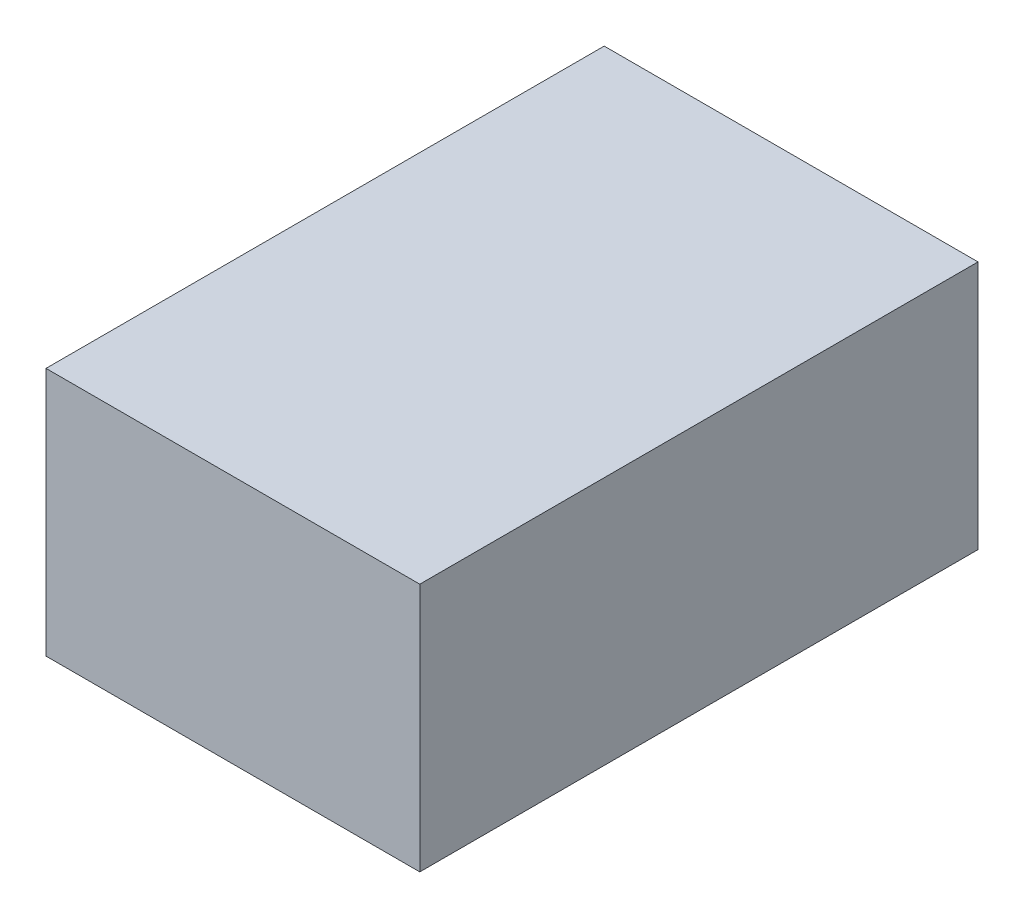
ISO-10303-21;
HEADER;
FILE_DESCRIPTION(('STEP AP214'),'2;1');
FILE_NAME('part.step','',(''),(''),'','','');
FILE_SCHEMA(('AUTOMOTIVE_DESIGN { 1 0 10303 214 1 1 1 1 }'));
ENDSEC;
DATA;
#1=APPLICATION_CONTEXT('core data for automotive mechanical design processes');
#2=APPLICATION_PROTOCOL_DEFINITION('international standard','automotive_design',2000,#1);
#3=PRODUCT_CONTEXT('',#1,'mechanical');
#4=PRODUCT('Part','Part','',(#3));
#5=PRODUCT_RELATED_PRODUCT_CATEGORY('part','',(#4));
#6=PRODUCT_DEFINITION_FORMATION('','',#4);
#7=PRODUCT_DEFINITION_CONTEXT('part definition',#1,'design');
#8=PRODUCT_DEFINITION('design','',#6,#7);
#9=PRODUCT_DEFINITION_SHAPE('','',#8);
#10=(LENGTH_UNIT() NAMED_UNIT(*) SI_UNIT(.MILLI.,.METRE.));
#11=(NAMED_UNIT(*) PLANE_ANGLE_UNIT() SI_UNIT($,.RADIAN.));
#12=(NAMED_UNIT(*) SI_UNIT($,.STERADIAN.) SOLID_ANGLE_UNIT());
#13=UNCERTAINTY_MEASURE_WITH_UNIT(LENGTH_MEASURE(1.E-05),#10,'distance_accuracy_value','');
#14=(GEOMETRIC_REPRESENTATION_CONTEXT(3) GLOBAL_UNCERTAINTY_ASSIGNED_CONTEXT((#13)) GLOBAL_UNIT_ASSIGNED_CONTEXT((#10,
#11,#12)) REPRESENTATION_CONTEXT('',''));
#15=CARTESIAN_POINT('',(0.,0.,0.));
#16=DIRECTION('',(0.,0.,1.));
#17=DIRECTION('',(1.,0.,0.));
#18=AXIS2_PLACEMENT_3D('',#15,#16,#17);
#19=CARTESIAN_POINT('',(25.14,2.77,14.48));
#20=DIRECTION('',(0.,1.,0.));
#21=DIRECTION('',(0.,0.,1.));
#22=AXIS2_PLACEMENT_3D('',#19,#20,#21);
#23=PLANE('',#22);
#24=DIRECTION('',(0.,0.,-1.));
#25=VECTOR('',#24,1.);
#26=CARTESIAN_POINT('',(22.,2.77,15.6));
#27=LINE('',#26,#25);
#28=CARTESIAN_POINT('',(22.,2.77,13.36));
#29=VERTEX_POINT('',#28);
#30=CARTESIAN_POINT('',(22.,2.77,15.6));
#31=VERTEX_POINT('',#30);
#32=EDGE_CURVE('E20',#29,#31,#27,.F.);
#33=ORIENTED_EDGE('',*,*,#32,.F.);
#34=DIRECTION('',(-1.,0.,0.));
#35=VECTOR('',#34,1.);
#36=CARTESIAN_POINT('',(22.,2.77,13.36));
#37=LINE('',#36,#35);
#38=CARTESIAN_POINT('',(20.5,2.77,13.36));
#39=VERTEX_POINT('',#38);
#40=EDGE_CURVE('E58',#39,#29,#37,.F.);
#41=ORIENTED_EDGE('',*,*,#40,.F.);
#42=DIRECTION('',(0.,0.,1.));
#43=VECTOR('',#42,1.);
#44=CARTESIAN_POINT('',(20.5,2.77,13.36));
#45=LINE('',#44,#43);
#46=CARTESIAN_POINT('',(20.5,2.77,15.6));
#47=VERTEX_POINT('',#46);
#48=EDGE_CURVE('E53',#47,#39,#45,.F.);
#49=ORIENTED_EDGE('',*,*,#48,.F.);
#50=DIRECTION('',(1.,0.,0.));
#51=VECTOR('',#50,1.);
#52=CARTESIAN_POINT('',(20.5,2.77,15.6));
#53=LINE('',#52,#51);
#54=EDGE_CURVE('E68',#31,#47,#53,.F.);
#55=ORIENTED_EDGE('',*,*,#54,.F.);
#56=EDGE_LOOP('',(#33,#41,#49,#55));
#57=FACE_BOUND('',#56,.T.);
#58=ADVANCED_FACE('F17',(#57),#23,.T.);
#59=CARTESIAN_POINT('',(22.,1.77,15.6));
#60=DIRECTION('',(1.,0.,0.));
#61=DIRECTION('',(0.,0.,-1.));
#62=AXIS2_PLACEMENT_3D('',#59,#60,#61);
#63=PLANE('',#62);
#64=DIRECTION('',(0.,0.,1.));
#65=VECTOR('',#64,1.);
#66=CARTESIAN_POINT('',(22.,1.77,14.48));
#67=LINE('',#66,#65);
#68=CARTESIAN_POINT('',(22.,1.77,15.6));
#69=VERTEX_POINT('',#68);
#70=CARTESIAN_POINT('',(22.,1.77,13.36));
#71=VERTEX_POINT('',#70);
#72=EDGE_CURVE('E74',#69,#71,#67,.F.);
#73=ORIENTED_EDGE('',*,*,#72,.T.);
#74=DIRECTION('',(0.,1.,0.));
#75=VECTOR('',#74,1.);
#76=CARTESIAN_POINT('',(22.,1.77,13.36));
#77=LINE('',#76,#75);
#78=EDGE_CURVE('E63',#29,#71,#77,.F.);
#79=ORIENTED_EDGE('',*,*,#78,.F.);
#80=ORIENTED_EDGE('',*,*,#32,.T.);
#81=DIRECTION('',(0.,1.,0.));
#82=VECTOR('',#81,1.);
#83=CARTESIAN_POINT('',(22.,1.77,15.6));
#84=LINE('',#83,#82);
#85=EDGE_CURVE('E81',#69,#31,#84,.T.);
#86=ORIENTED_EDGE('',*,*,#85,.F.);
#87=EDGE_LOOP('',(#73,#79,#80,#86));
#88=FACE_BOUND('',#87,.T.);
#89=ADVANCED_FACE('F73',(#88),#63,.T.);
#90=CARTESIAN_POINT('',(22.,1.77,13.36));
#91=DIRECTION('',(0.,0.,-1.));
#92=DIRECTION('',(-1.,0.,0.));
#93=AXIS2_PLACEMENT_3D('',#90,#91,#92);
#94=PLANE('',#93);
#95=DIRECTION('',(1.,0.,0.));
#96=VECTOR('',#95,1.);
#97=CARTESIAN_POINT('',(21.25,1.77,13.36));
#98=LINE('',#97,#96);
#99=CARTESIAN_POINT('',(20.5,1.77,13.36));
#100=VERTEX_POINT('',#99);
#101=EDGE_CURVE('E84',#71,#100,#98,.F.);
#102=ORIENTED_EDGE('',*,*,#101,.T.);
#103=DIRECTION('',(0.,1.,0.));
#104=VECTOR('',#103,1.);
#105=CARTESIAN_POINT('',(20.5,1.77,13.36));
#106=LINE('',#105,#104);
#107=EDGE_CURVE('E65',#39,#100,#106,.F.);
#108=ORIENTED_EDGE('',*,*,#107,.F.);
#109=ORIENTED_EDGE('',*,*,#40,.T.);
#110=ORIENTED_EDGE('',*,*,#78,.T.);
#111=EDGE_LOOP('',(#102,#108,#109,#110));
#112=FACE_BOUND('',#111,.T.);
#113=ADVANCED_FACE('F61',(#112),#94,.T.);
#114=CARTESIAN_POINT('',(20.5,1.77,13.36));
#115=DIRECTION('',(-1.,0.,0.));
#116=DIRECTION('',(0.,0.,1.));
#117=AXIS2_PLACEMENT_3D('',#114,#115,#116);
#118=PLANE('',#117);
#119=DIRECTION('',(0.,0.,1.));
#120=VECTOR('',#119,1.);
#121=CARTESIAN_POINT('',(20.5,1.77,14.48));
#122=LINE('',#121,#120);
#123=CARTESIAN_POINT('',(20.5,1.77,15.6));
#124=VERTEX_POINT('',#123);
#125=EDGE_CURVE('E26',#100,#124,#122,.T.);
#126=ORIENTED_EDGE('',*,*,#125,.T.);
#127=DIRECTION('',(0.,1.,0.));
#128=VECTOR('',#127,1.);
#129=CARTESIAN_POINT('',(20.5,1.77,15.6));
#130=LINE('',#129,#128);
#131=EDGE_CURVE('E34',#47,#124,#130,.F.);
#132=ORIENTED_EDGE('',*,*,#131,.F.);
#133=ORIENTED_EDGE('',*,*,#48,.T.);
#134=ORIENTED_EDGE('',*,*,#107,.T.);
#135=EDGE_LOOP('',(#126,#132,#133,#134));
#136=FACE_BOUND('',#135,.T.);
#137=ADVANCED_FACE('F88',(#136),#118,.T.);
#138=CARTESIAN_POINT('',(20.5,1.77,15.6));
#139=DIRECTION('',(0.,0.,1.));
#140=DIRECTION('',(1.,0.,0.));
#141=AXIS2_PLACEMENT_3D('',#138,#139,#140);
#142=PLANE('',#141);
#143=DIRECTION('',(1.,0.,0.));
#144=VECTOR('',#143,1.);
#145=CARTESIAN_POINT('',(21.25,1.77,15.6));
#146=LINE('',#145,#144);
#147=EDGE_CURVE('E11',#124,#69,#146,.T.);
#148=ORIENTED_EDGE('',*,*,#147,.T.);
#149=ORIENTED_EDGE('',*,*,#85,.T.);
#150=ORIENTED_EDGE('',*,*,#54,.T.);
#151=ORIENTED_EDGE('',*,*,#131,.T.);
#152=EDGE_LOOP('',(#148,#149,#150,#151));
#153=FACE_BOUND('',#152,.T.);
#154=ADVANCED_FACE('F91',(#153),#142,.T.);
#155=CARTESIAN_POINT('',(21.25,1.77,14.48));
#156=DIRECTION('',(0.,1.,0.));
#157=DIRECTION('',(0.,0.,1.));
#158=AXIS2_PLACEMENT_3D('',#155,#156,#157);
#159=PLANE('',#158);
#160=ORIENTED_EDGE('',*,*,#125,.F.);
#161=ORIENTED_EDGE('',*,*,#101,.F.);
#162=ORIENTED_EDGE('',*,*,#72,.F.);
#163=ORIENTED_EDGE('',*,*,#147,.F.);
#164=EDGE_LOOP('',(#160,#161,#162,#163));
#165=FACE_BOUND('',#164,.T.);
#166=ADVANCED_FACE('F90',(#165),#159,.F.);
#167=CLOSED_SHELL('',(#58,#89,#113,#137,#154,#166));
#168=MANIFOLD_SOLID_BREP('B1',#167);
#169=ADVANCED_BREP_SHAPE_REPRESENTATION('',(#18,#168),#14);
#170=SHAPE_DEFINITION_REPRESENTATION(#9,#169);
ENDSEC;
END-ISO-10303-21;
